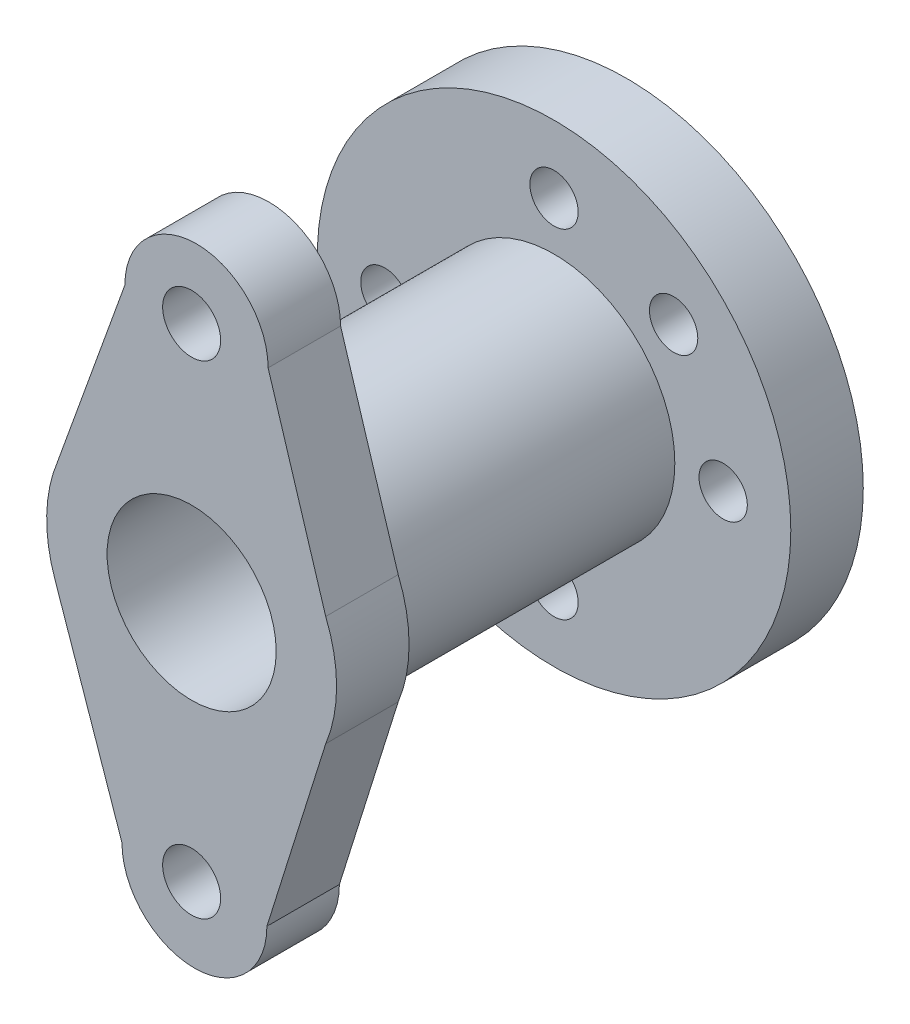
ISO-10303-21;
HEADER;
FILE_DESCRIPTION(('STEP AP214'),'2;1');
FILE_NAME('part.step','',(''),(''),'','','');
FILE_SCHEMA(('AUTOMOTIVE_DESIGN { 1 0 10303 214 1 1 1 1 }'));
ENDSEC;
DATA;
#1=APPLICATION_CONTEXT('core data for automotive mechanical design processes');
#2=APPLICATION_PROTOCOL_DEFINITION('international standard','automotive_design',2000,#1);
#3=PRODUCT_CONTEXT('',#1,'mechanical');
#4=PRODUCT('Part','Part','',(#3));
#5=PRODUCT_RELATED_PRODUCT_CATEGORY('part','',(#4));
#6=PRODUCT_DEFINITION_FORMATION('','',#4);
#7=PRODUCT_DEFINITION_CONTEXT('part definition',#1,'design');
#8=PRODUCT_DEFINITION('design','',#6,#7);
#9=PRODUCT_DEFINITION_SHAPE('','',#8);
#10=(LENGTH_UNIT() NAMED_UNIT(*) SI_UNIT(.MILLI.,.METRE.));
#11=(NAMED_UNIT(*) PLANE_ANGLE_UNIT() SI_UNIT($,.RADIAN.));
#12=(NAMED_UNIT(*) SI_UNIT($,.STERADIAN.) SOLID_ANGLE_UNIT());
#13=UNCERTAINTY_MEASURE_WITH_UNIT(LENGTH_MEASURE(1.E-05),#10,'distance_accuracy_value','');
#14=(GEOMETRIC_REPRESENTATION_CONTEXT(3) GLOBAL_UNCERTAINTY_ASSIGNED_CONTEXT((#13)) GLOBAL_UNIT_ASSIGNED_CONTEXT((#10,
#11,#12)) REPRESENTATION_CONTEXT('',''));
#15=CARTESIAN_POINT('',(0.,0.,0.));
#16=DIRECTION('',(0.,0.,1.));
#17=DIRECTION('',(1.,0.,0.));
#18=AXIS2_PLACEMENT_3D('',#15,#16,#17);
#19=CARTESIAN_POINT('',(2.0009573195602,-3.50167530923036,15.));
#20=DIRECTION('',(0.,0.,1.));
#21=DIRECTION('',(1.,0.,0.));
#22=AXIS2_PLACEMENT_3D('',#19,#20,#21);
#23=PLANE('',#22);
#24=CARTESIAN_POINT('',(2.0009573195602,-3.50167530923036,15.));
#25=DIRECTION('',(0.,0.,1.));
#26=DIRECTION('',(1.,0.,0.));
#27=AXIS2_PLACEMENT_3D('',#24,#25,#26);
#28=CIRCLE('',#27,25.);
#29=CARTESIAN_POINT('',(27.0009573195602,-3.50167530923036,15.));
#30=VERTEX_POINT('',#29);
#31=EDGE_CURVE('E12',#30,#30,#28,.T.);
#32=ORIENTED_EDGE('',*,*,#31,.F.);
#33=EDGE_LOOP('',(#32));
#34=FACE_BOUND('',#33,.T.);
#35=CARTESIAN_POINT('',(26.7496946610893,21.2470620322989,15.));
#36=DIRECTION('',(0.,0.,1.));
#37=DIRECTION('',(1.,0.,0.));
#38=AXIS2_PLACEMENT_3D('',#35,#36,#37);
#39=CIRCLE('',#38,5.);
#40=CARTESIAN_POINT('',(31.7496946610893,21.2470620322989,15.));
#41=VERTEX_POINT('',#40);
#42=EDGE_CURVE('E229',#41,#41,#39,.T.);
#43=ORIENTED_EDGE('',*,*,#42,.F.);
#44=EDGE_LOOP('',(#43));
#45=FACE_BOUND('',#44,.T.);
#46=CARTESIAN_POINT('',(2.0009573195602,-38.5016753092304,15.));
#47=DIRECTION('',(0.,0.,1.));
#48=DIRECTION('',(1.,0.,0.));
#49=AXIS2_PLACEMENT_3D('',#46,#47,#48);
#50=CIRCLE('',#49,5.);
#51=CARTESIAN_POINT('',(7.0009573195602,-38.5016753092304,15.));
#52=VERTEX_POINT('',#51);
#53=EDGE_CURVE('E241',#52,#52,#50,.T.);
#54=ORIENTED_EDGE('',*,*,#53,.F.);
#55=EDGE_LOOP('',(#54));
#56=FACE_BOUND('',#55,.T.);
#57=CARTESIAN_POINT('',(2.0009573195602,31.4983246907696,15.));
#58=DIRECTION('',(0.,0.,1.));
#59=DIRECTION('',(1.,0.,0.));
#60=AXIS2_PLACEMENT_3D('',#57,#58,#59);
#61=CIRCLE('',#60,5.);
#62=CARTESIAN_POINT('',(7.0009573195602,31.4983246907696,15.));
#63=VERTEX_POINT('',#62);
#64=EDGE_CURVE('E253',#63,#63,#61,.T.);
#65=ORIENTED_EDGE('',*,*,#64,.F.);
#66=EDGE_LOOP('',(#65));
#67=FACE_BOUND('',#66,.T.);
#68=CARTESIAN_POINT('',(2.0009573195602,-3.50167530923036,15.));
#69=DIRECTION('',(0.,0.,1.));
#70=DIRECTION('',(1.,0.,0.));
#71=AXIS2_PLACEMENT_3D('',#68,#69,#70);
#72=CIRCLE('',#71,49.);
#73=CARTESIAN_POINT('',(51.0009573195602,-3.50167530923036,15.));
#74=VERTEX_POINT('',#73);
#75=EDGE_CURVE('E51',#74,#74,#72,.T.);
#76=ORIENTED_EDGE('',*,*,#75,.T.);
#77=EDGE_LOOP('',(#76));
#78=FACE_BOUND('',#77,.T.);
#79=CARTESIAN_POINT('',(37.0009573195602,-3.50167530923036,15.));
#80=DIRECTION('',(0.,0.,1.));
#81=DIRECTION('',(1.,0.,0.));
#82=AXIS2_PLACEMENT_3D('',#79,#80,#81);
#83=CIRCLE('',#82,5.);
#84=CARTESIAN_POINT('',(42.0009573195602,-3.50167530923036,15.));
#85=VERTEX_POINT('',#84);
#86=EDGE_CURVE('E247',#85,#85,#83,.T.);
#87=ORIENTED_EDGE('',*,*,#86,.F.);
#88=EDGE_LOOP('',(#87));
#89=FACE_BOUND('',#88,.T.);
#90=CARTESIAN_POINT('',(-32.9990426804398,-3.50167530923036,15.));
#91=DIRECTION('',(0.,0.,1.));
#92=DIRECTION('',(1.,0.,0.));
#93=AXIS2_PLACEMENT_3D('',#90,#91,#92);
#94=CIRCLE('',#93,5.);
#95=CARTESIAN_POINT('',(-27.9990426804398,-3.50167530923036,15.));
#96=VERTEX_POINT('',#95);
#97=EDGE_CURVE('E235',#96,#96,#94,.T.);
#98=ORIENTED_EDGE('',*,*,#97,.F.);
#99=EDGE_LOOP('',(#98));
#100=FACE_BOUND('',#99,.T.);
#101=CARTESIAN_POINT('',(-22.7477800219689,-28.2504126507596,15.));
#102=DIRECTION('',(0.,0.,1.));
#103=DIRECTION('',(1.,0.,0.));
#104=AXIS2_PLACEMENT_3D('',#101,#102,#103);
#105=CIRCLE('',#104,5.);
#106=CARTESIAN_POINT('',(-17.7477800219689,-28.2504126507596,15.));
#107=VERTEX_POINT('',#106);
#108=EDGE_CURVE('E223',#107,#107,#105,.T.);
#109=ORIENTED_EDGE('',*,*,#108,.F.);
#110=EDGE_LOOP('',(#109));
#111=FACE_BOUND('',#110,.T.);
#112=ADVANCED_FACE('F41',(#34,#45,#56,#67,#78,#89,#100,#111),#23,.T.);
#113=CARTESIAN_POINT('',(2.0009573195602,-3.50167530923036,0.));
#114=DIRECTION('',(0.,0.,1.));
#115=DIRECTION('',(1.,0.,0.));
#116=AXIS2_PLACEMENT_3D('',#113,#114,#115);
#117=PLANE('',#116);
#118=CARTESIAN_POINT('',(2.0009573195602,-3.50167530923036,0.));
#119=DIRECTION('',(0.,0.,1.));
#120=DIRECTION('',(1.,0.,0.));
#121=AXIS2_PLACEMENT_3D('',#118,#119,#120);
#122=CIRCLE('',#121,49.);
#123=CARTESIAN_POINT('',(51.0009573195602,-3.50167530923036,0.));
#124=VERTEX_POINT('',#123);
#125=EDGE_CURVE('E45',#124,#124,#122,.T.);
#126=ORIENTED_EDGE('',*,*,#125,.F.);
#127=EDGE_LOOP('',(#126));
#128=FACE_BOUND('',#127,.T.);
#129=CARTESIAN_POINT('',(2.0009573195602,31.4983246907696,0.));
#130=DIRECTION('',(0.,0.,1.));
#131=DIRECTION('',(1.,0.,0.));
#132=AXIS2_PLACEMENT_3D('',#129,#130,#131);
#133=CIRCLE('',#132,5.);
#134=CARTESIAN_POINT('',(7.0009573195602,31.4983246907696,0.));
#135=VERTEX_POINT('',#134);
#136=EDGE_CURVE('E250',#135,#135,#133,.T.);
#137=ORIENTED_EDGE('',*,*,#136,.T.);
#138=EDGE_LOOP('',(#137));
#139=FACE_BOUND('',#138,.T.);
#140=CARTESIAN_POINT('',(37.0009573195602,-3.50167530923036,0.));
#141=DIRECTION('',(0.,0.,1.));
#142=DIRECTION('',(1.,0.,0.));
#143=AXIS2_PLACEMENT_3D('',#140,#141,#142);
#144=CIRCLE('',#143,5.);
#145=CARTESIAN_POINT('',(42.0009573195602,-3.50167530923036,0.));
#146=VERTEX_POINT('',#145);
#147=EDGE_CURVE('E244',#146,#146,#144,.T.);
#148=ORIENTED_EDGE('',*,*,#147,.T.);
#149=EDGE_LOOP('',(#148));
#150=FACE_BOUND('',#149,.T.);
#151=CARTESIAN_POINT('',(2.0009573195602,-38.5016753092304,0.));
#152=DIRECTION('',(0.,0.,1.));
#153=DIRECTION('',(1.,0.,0.));
#154=AXIS2_PLACEMENT_3D('',#151,#152,#153);
#155=CIRCLE('',#154,5.);
#156=CARTESIAN_POINT('',(7.0009573195602,-38.5016753092304,0.));
#157=VERTEX_POINT('',#156);
#158=EDGE_CURVE('E238',#157,#157,#155,.T.);
#159=ORIENTED_EDGE('',*,*,#158,.T.);
#160=EDGE_LOOP('',(#159));
#161=FACE_BOUND('',#160,.T.);
#162=CARTESIAN_POINT('',(-32.9990426804398,-3.50167530923036,0.));
#163=DIRECTION('',(0.,0.,1.));
#164=DIRECTION('',(1.,0.,0.));
#165=AXIS2_PLACEMENT_3D('',#162,#163,#164);
#166=CIRCLE('',#165,5.);
#167=CARTESIAN_POINT('',(-27.9990426804398,-3.50167530923036,0.));
#168=VERTEX_POINT('',#167);
#169=EDGE_CURVE('E232',#168,#168,#166,.T.);
#170=ORIENTED_EDGE('',*,*,#169,.T.);
#171=EDGE_LOOP('',(#170));
#172=FACE_BOUND('',#171,.T.);
#173=CARTESIAN_POINT('',(26.7496946610893,21.2470620322989,0.));
#174=DIRECTION('',(0.,0.,1.));
#175=DIRECTION('',(1.,0.,0.));
#176=AXIS2_PLACEMENT_3D('',#173,#174,#175);
#177=CIRCLE('',#176,5.);
#178=CARTESIAN_POINT('',(31.7496946610893,21.2470620322989,0.));
#179=VERTEX_POINT('',#178);
#180=EDGE_CURVE('E226',#179,#179,#177,.T.);
#181=ORIENTED_EDGE('',*,*,#180,.T.);
#182=EDGE_LOOP('',(#181));
#183=FACE_BOUND('',#182,.T.);
#184=CARTESIAN_POINT('',(-22.7477800219689,-28.2504126507596,0.));
#185=DIRECTION('',(0.,0.,1.));
#186=DIRECTION('',(1.,0.,0.));
#187=AXIS2_PLACEMENT_3D('',#184,#185,#186);
#188=CIRCLE('',#187,5.);
#189=CARTESIAN_POINT('',(-17.7477800219689,-28.2504126507596,0.));
#190=VERTEX_POINT('',#189);
#191=EDGE_CURVE('E221',#190,#190,#188,.T.);
#192=ORIENTED_EDGE('',*,*,#191,.T.);
#193=EDGE_LOOP('',(#192));
#194=FACE_BOUND('',#193,.T.);
#195=ADVANCED_FACE('F264',(#128,#139,#150,#161,#172,#183,#194),#117,.F.);
#196=CARTESIAN_POINT('',(2.0009573195602,-3.50167530923036,15.));
#197=DIRECTION('',(0.,0.,-1.));
#198=DIRECTION('',(-1.,0.,0.));
#199=AXIS2_PLACEMENT_3D('',#196,#197,#198);
#200=CYLINDRICAL_SURFACE('',#199,49.);
#201=ORIENTED_EDGE('',*,*,#75,.F.);
#202=EDGE_LOOP('',(#201));
#203=FACE_BOUND('',#202,.T.);
#204=ORIENTED_EDGE('',*,*,#125,.T.);
#205=EDGE_LOOP('',(#204));
#206=FACE_BOUND('',#205,.T.);
#207=ADVANCED_FACE('F43',(#203,#206),#200,.T.);
#208=CARTESIAN_POINT('',(2.0009573195602,31.4983246907696,15.));
#209=DIRECTION('',(0.,0.,-1.));
#210=DIRECTION('',(-1.,0.,0.));
#211=AXIS2_PLACEMENT_3D('',#208,#209,#210);
#212=CYLINDRICAL_SURFACE('',#211,5.);
#213=ORIENTED_EDGE('',*,*,#64,.T.);
#214=EDGE_LOOP('',(#213));
#215=FACE_BOUND('',#214,.T.);
#216=ORIENTED_EDGE('',*,*,#136,.F.);
#217=EDGE_LOOP('',(#216));
#218=FACE_BOUND('',#217,.T.);
#219=ADVANCED_FACE('F302',(#215,#218),#212,.F.);
#220=CARTESIAN_POINT('',(37.0009573195602,-3.50167530923036,15.));
#221=DIRECTION('',(0.,0.,-1.));
#222=DIRECTION('',(-1.,0.,0.));
#223=AXIS2_PLACEMENT_3D('',#220,#221,#222);
#224=CYLINDRICAL_SURFACE('',#223,5.);
#225=ORIENTED_EDGE('',*,*,#86,.T.);
#226=EDGE_LOOP('',(#225));
#227=FACE_BOUND('',#226,.T.);
#228=ORIENTED_EDGE('',*,*,#147,.F.);
#229=EDGE_LOOP('',(#228));
#230=FACE_BOUND('',#229,.T.);
#231=ADVANCED_FACE('F305',(#227,#230),#224,.F.);
#232=CARTESIAN_POINT('',(2.0009573195602,-38.5016753092304,15.));
#233=DIRECTION('',(0.,0.,-1.));
#234=DIRECTION('',(-1.,0.,0.));
#235=AXIS2_PLACEMENT_3D('',#232,#233,#234);
#236=CYLINDRICAL_SURFACE('',#235,5.);
#237=ORIENTED_EDGE('',*,*,#53,.T.);
#238=EDGE_LOOP('',(#237));
#239=FACE_BOUND('',#238,.T.);
#240=ORIENTED_EDGE('',*,*,#158,.F.);
#241=EDGE_LOOP('',(#240));
#242=FACE_BOUND('',#241,.T.);
#243=ADVANCED_FACE('F309',(#239,#242),#236,.F.);
#244=CARTESIAN_POINT('',(-32.9990426804398,-3.50167530923036,15.));
#245=DIRECTION('',(0.,0.,-1.));
#246=DIRECTION('',(-1.,0.,0.));
#247=AXIS2_PLACEMENT_3D('',#244,#245,#246);
#248=CYLINDRICAL_SURFACE('',#247,5.);
#249=ORIENTED_EDGE('',*,*,#97,.T.);
#250=EDGE_LOOP('',(#249));
#251=FACE_BOUND('',#250,.T.);
#252=ORIENTED_EDGE('',*,*,#169,.F.);
#253=EDGE_LOOP('',(#252));
#254=FACE_BOUND('',#253,.T.);
#255=ADVANCED_FACE('F291',(#251,#254),#248,.F.);
#256=CARTESIAN_POINT('',(26.7496946610893,21.2470620322989,15.));
#257=DIRECTION('',(0.,0.,-1.));
#258=DIRECTION('',(-1.,0.,0.));
#259=AXIS2_PLACEMENT_3D('',#256,#257,#258);
#260=CYLINDRICAL_SURFACE('',#259,5.);
#261=ORIENTED_EDGE('',*,*,#42,.T.);
#262=EDGE_LOOP('',(#261));
#263=FACE_BOUND('',#262,.T.);
#264=ORIENTED_EDGE('',*,*,#180,.F.);
#265=EDGE_LOOP('',(#264));
#266=FACE_BOUND('',#265,.T.);
#267=ADVANCED_FACE('F282',(#263,#266),#260,.F.);
#268=CARTESIAN_POINT('',(-22.7477800219689,-28.2504126507596,15.));
#269=DIRECTION('',(0.,0.,-1.));
#270=DIRECTION('',(-1.,0.,0.));
#271=AXIS2_PLACEMENT_3D('',#268,#269,#270);
#272=CYLINDRICAL_SURFACE('',#271,5.);
#273=ORIENTED_EDGE('',*,*,#108,.T.);
#274=EDGE_LOOP('',(#273));
#275=FACE_BOUND('',#274,.T.);
#276=ORIENTED_EDGE('',*,*,#191,.F.);
#277=EDGE_LOOP('',(#276));
#278=FACE_BOUND('',#277,.T.);
#279=ADVANCED_FACE('F279',(#275,#278),#272,.F.);
#280=CARTESIAN_POINT('',(2.0009573195602,-3.50167530923036,75.));
#281=DIRECTION('',(0.,0.,-1.));
#282=DIRECTION('',(-1.,0.,0.));
#283=AXIS2_PLACEMENT_3D('',#280,#281,#282);
#284=CYLINDRICAL_SURFACE('',#283,25.);
#285=CARTESIAN_POINT('',(2.0009573195602,-3.50167530923036,75.));
#286=DIRECTION('',(0.,0.,1.));
#287=DIRECTION('',(1.,0.,0.));
#288=AXIS2_PLACEMENT_3D('',#285,#286,#287);
#289=CIRCLE('',#288,25.);
#290=CARTESIAN_POINT('',(27.0009573195602,-3.50167530923036,75.));
#291=VERTEX_POINT('',#290);
#292=EDGE_CURVE('E219',#291,#291,#289,.T.);
#293=ORIENTED_EDGE('',*,*,#292,.F.);
#294=EDGE_LOOP('',(#293));
#295=FACE_BOUND('',#294,.T.);
#296=ORIENTED_EDGE('',*,*,#31,.T.);
#297=EDGE_LOOP('',(#296));
#298=FACE_BOUND('',#297,.T.);
#299=ADVANCED_FACE('F281',(#295,#298),#284,.T.);
#300=CARTESIAN_POINT('',(0.,0.,75.));
#301=DIRECTION('',(0.,0.,-1.));
#302=DIRECTION('',(-1.,0.,0.));
#303=AXIS2_PLACEMENT_3D('',#300,#301,#302);
#304=PLANE('',#303);
#305=ORIENTED_EDGE('',*,*,#292,.T.);
#306=EDGE_LOOP('',(#305));
#307=FACE_BOUND('',#306,.T.);
#308=CARTESIAN_POINT('',(2.0009573195602,46.5010851804684,75.));
#309=DIRECTION('',(0.,0.,1.));
#310=DIRECTION('',(1.,0.,0.));
#311=AXIS2_PLACEMENT_3D('',#308,#309,#310);
#312=CIRCLE('',#311,6.);
#313=CARTESIAN_POINT('',(8.0009573195602,46.5010851804684,75.));
#314=VERTEX_POINT('',#313);
#315=EDGE_CURVE('E135',#314,#314,#312,.T.);
#316=ORIENTED_EDGE('',*,*,#315,.T.);
#317=EDGE_LOOP('',(#316));
#318=FACE_BOUND('',#317,.T.);
#319=CARTESIAN_POINT('',(2.57930255673431,-53.7079312906423,75.));
#320=DIRECTION('',(0.,0.,1.));
#321=DIRECTION('',(1.,0.,0.));
#322=AXIS2_PLACEMENT_3D('',#319,#320,#321);
#323=CIRCLE('',#322,15.);
#324=CARTESIAN_POINT('',(-12.4206974432657,-53.7079312906423,75.));
#325=VERTEX_POINT('',#324);
#326=CARTESIAN_POINT('',(17.5793025567343,-53.7079312906423,75.));
#327=VERTEX_POINT('',#326);
#328=EDGE_CURVE('E131',#325,#327,#323,.T.);
#329=ORIENTED_EDGE('',*,*,#328,.F.);
#330=DIRECTION('',(0.325940739036391,-0.9453902023167,0.));
#331=VECTOR('',#330,1.);
#332=CARTESIAN_POINT('',(-12.4206974432657,-53.7079312906423,75.));
#333=LINE('',#332,#331);
#334=CARTESIAN_POINT('',(-26.2568050216251,-13.5763399423131,75.));
#335=VERTEX_POINT('',#334);
#336=EDGE_CURVE('E106',#335,#325,#333,.T.);
#337=ORIENTED_EDGE('',*,*,#336,.F.);
#338=CARTESIAN_POINT('',(2.0009573195602,-3.50167530923036,75.));
#339=DIRECTION('',(0.,0.,1.));
#340=DIRECTION('',(1.,0.,0.));
#341=AXIS2_PLACEMENT_3D('',#338,#339,#340);
#342=CIRCLE('',#341,30.);
#343=CARTESIAN_POINT('',(-25.7458515982972,7.90510315254003,75.));
#344=VERTEX_POINT('',#343);
#345=EDGE_CURVE('E113',#344,#335,#342,.T.);
#346=ORIENTED_EDGE('',*,*,#345,.F.);
#347=DIRECTION('',(-0.339419327269756,-0.940635168530152,0.));
#348=VECTOR('',#347,1.);
#349=CARTESIAN_POINT('',(-11.819851667689,46.4983246907697,75.));
#350=LINE('',#349,#348);
#351=CARTESIAN_POINT('',(-11.819851667689,46.4983246907697,75.));
#352=VERTEX_POINT('',#351);
#353=EDGE_CURVE('E198',#352,#344,#350,.T.);
#354=ORIENTED_EDGE('',*,*,#353,.F.);
#355=CARTESIAN_POINT('',(3.00438617084908,46.4983246907696,75.));
#356=DIRECTION('',(0.,0.,1.));
#357=DIRECTION('',(1.,0.,0.));
#358=AXIS2_PLACEMENT_3D('',#355,#356,#357);
#359=CIRCLE('',#358,14.8242378385381);
#360=CARTESIAN_POINT('',(17.8286240093871,46.4983246907696,75.));
#361=VERTEX_POINT('',#360);
#362=EDGE_CURVE('E184',#361,#352,#359,.T.);
#363=ORIENTED_EDGE('',*,*,#362,.F.);
#364=DIRECTION('',(-0.295087697485455,0.955470172633731,0.));
#365=VECTOR('',#364,1.);
#366=CARTESIAN_POINT('',(17.8286240093871,46.4983246907696,75.));
#367=LINE('',#366,#365);
#368=CARTESIAN_POINT('',(29.7477662374176,7.90510315254003,75.));
#369=VERTEX_POINT('',#368);
#370=EDGE_CURVE('E170',#369,#361,#367,.T.);
#371=ORIENTED_EDGE('',*,*,#370,.F.);
#372=CARTESIAN_POINT('',(2.0009573195602,-3.50167530923036,75.));
#373=DIRECTION('',(0.,0.,1.));
#374=DIRECTION('',(1.,0.,0.));
#375=AXIS2_PLACEMENT_3D('',#372,#373,#374);
#376=CIRCLE('',#375,30.);
#377=CARTESIAN_POINT('',(29.7477662374176,-14.9084537710008,75.));
#378=VERTEX_POINT('',#377);
#379=EDGE_CURVE('E156',#378,#369,#376,.T.);
#380=ORIENTED_EDGE('',*,*,#379,.F.);
#381=DIRECTION('',(0.29925227709934,0.95417402744513,0.));
#382=VECTOR('',#381,1.);
#383=CARTESIAN_POINT('',(17.5793025567343,-53.7079312906423,75.));
#384=LINE('',#383,#382);
#385=EDGE_CURVE('E147',#327,#378,#384,.T.);
#386=ORIENTED_EDGE('',*,*,#385,.F.);
#387=EDGE_LOOP('',(#329,#337,#346,#354,#363,#371,#380,#386));
#388=FACE_BOUND('',#387,.T.);
#389=CARTESIAN_POINT('',(2.0009573195602,-53.5028788227911,75.));
#390=DIRECTION('',(0.,0.,1.));
#391=DIRECTION('',(1.,0.,0.));
#392=AXIS2_PLACEMENT_3D('',#389,#390,#391);
#393=CIRCLE('',#392,6.);
#394=CARTESIAN_POINT('',(8.0009573195602,-53.5028788227911,75.));
#395=VERTEX_POINT('',#394);
#396=EDGE_CURVE('E490',#395,#395,#393,.T.);
#397=ORIENTED_EDGE('',*,*,#396,.T.);
#398=EDGE_LOOP('',(#397));
#399=FACE_BOUND('',#398,.T.);
#400=ADVANCED_FACE('F128',(#307,#318,#388,#399),#304,.T.);
#401=CARTESIAN_POINT('',(0.,0.,90.));
#402=DIRECTION('',(0.,0.,-1.));
#403=DIRECTION('',(-1.,0.,0.));
#404=AXIS2_PLACEMENT_3D('',#401,#402,#403);
#405=PLANE('',#404);
#406=CARTESIAN_POINT('',(2.57930255673431,-53.7079312906423,90.));
#407=DIRECTION('',(0.,0.,1.));
#408=DIRECTION('',(1.,0.,0.));
#409=AXIS2_PLACEMENT_3D('',#406,#407,#408);
#410=CIRCLE('',#409,15.);
#411=CARTESIAN_POINT('',(-12.4206974432657,-53.7079312906423,90.));
#412=VERTEX_POINT('',#411);
#413=CARTESIAN_POINT('',(17.5793025567343,-53.7079312906423,90.));
#414=VERTEX_POINT('',#413);
#415=EDGE_CURVE('E144',#412,#414,#410,.T.);
#416=ORIENTED_EDGE('',*,*,#415,.T.);
#417=DIRECTION('',(0.29925227709934,0.95417402744513,0.));
#418=VECTOR('',#417,1.);
#419=CARTESIAN_POINT('',(17.5793025567343,-53.7079312906423,90.));
#420=LINE('',#419,#418);
#421=CARTESIAN_POINT('',(29.7477662374176,-14.9084537710008,90.));
#422=VERTEX_POINT('',#421);
#423=EDGE_CURVE('E60',#414,#422,#420,.T.);
#424=ORIENTED_EDGE('',*,*,#423,.T.);
#425=CARTESIAN_POINT('',(2.0009573195602,-3.50167530923036,90.));
#426=DIRECTION('',(0.,0.,1.));
#427=DIRECTION('',(1.,0.,0.));
#428=AXIS2_PLACEMENT_3D('',#425,#426,#427);
#429=CIRCLE('',#428,30.);
#430=CARTESIAN_POINT('',(29.7477662374176,7.90510315254003,90.));
#431=VERTEX_POINT('',#430);
#432=EDGE_CURVE('E150',#422,#431,#429,.T.);
#433=ORIENTED_EDGE('',*,*,#432,.T.);
#434=DIRECTION('',(-0.295087697485455,0.955470172633731,0.));
#435=VECTOR('',#434,1.);
#436=CARTESIAN_POINT('',(17.8286240093871,46.4983246907696,90.));
#437=LINE('',#436,#435);
#438=CARTESIAN_POINT('',(17.8286240093871,46.4983246907696,90.));
#439=VERTEX_POINT('',#438);
#440=EDGE_CURVE('E164',#431,#439,#437,.T.);
#441=ORIENTED_EDGE('',*,*,#440,.T.);
#442=CARTESIAN_POINT('',(3.00438617084908,46.4983246907696,90.));
#443=DIRECTION('',(0.,0.,1.));
#444=DIRECTION('',(1.,0.,0.));
#445=AXIS2_PLACEMENT_3D('',#442,#443,#444);
#446=CIRCLE('',#445,14.8242378385381);
#447=CARTESIAN_POINT('',(-11.819851667689,46.4983246907697,90.));
#448=VERTEX_POINT('',#447);
#449=EDGE_CURVE('E178',#439,#448,#446,.T.);
#450=ORIENTED_EDGE('',*,*,#449,.T.);
#451=DIRECTION('',(-0.339419327269756,-0.940635168530152,0.));
#452=VECTOR('',#451,1.);
#453=CARTESIAN_POINT('',(-11.819851667689,46.4983246907697,90.));
#454=LINE('',#453,#452);
#455=CARTESIAN_POINT('',(-25.7458515982972,7.90510315254002,90.));
#456=VERTEX_POINT('',#455);
#457=EDGE_CURVE('E192',#448,#456,#454,.T.);
#458=ORIENTED_EDGE('',*,*,#457,.T.);
#459=CARTESIAN_POINT('',(2.0009573195602,-3.50167530923036,90.));
#460=DIRECTION('',(0.,0.,1.));
#461=DIRECTION('',(1.,0.,0.));
#462=AXIS2_PLACEMENT_3D('',#459,#460,#461);
#463=CIRCLE('',#462,30.);
#464=CARTESIAN_POINT('',(-26.2568050216251,-13.5763399423131,90.));
#465=VERTEX_POINT('',#464);
#466=EDGE_CURVE('E206',#456,#465,#463,.T.);
#467=ORIENTED_EDGE('',*,*,#466,.T.);
#468=DIRECTION('',(0.325940739036391,-0.9453902023167,0.));
#469=VECTOR('',#468,1.);
#470=CARTESIAN_POINT('',(-12.4206974432657,-53.7079312906423,90.));
#471=LINE('',#470,#469);
#472=EDGE_CURVE('E125',#465,#412,#471,.T.);
#473=ORIENTED_EDGE('',*,*,#472,.T.);
#474=EDGE_LOOP('',(#416,#424,#433,#441,#450,#458,#467,#473));
#475=FACE_BOUND('',#474,.T.);
#476=CARTESIAN_POINT('',(2.0009573195602,-3.50167530923036,90.));
#477=DIRECTION('',(0.,0.,1.));
#478=DIRECTION('',(1.,0.,0.));
#479=AXIS2_PLACEMENT_3D('',#476,#477,#478);
#480=CIRCLE('',#479,17.5);
#481=CARTESIAN_POINT('',(19.5009573195602,-3.50167530923036,90.));
#482=VERTEX_POINT('',#481);
#483=EDGE_CURVE('E132',#482,#482,#480,.T.);
#484=ORIENTED_EDGE('',*,*,#483,.F.);
#485=EDGE_LOOP('',(#484));
#486=FACE_BOUND('',#485,.T.);
#487=CARTESIAN_POINT('',(2.0009573195602,46.5010851804684,90.));
#488=DIRECTION('',(0.,0.,1.));
#489=DIRECTION('',(1.,0.,0.));
#490=AXIS2_PLACEMENT_3D('',#487,#488,#489);
#491=CIRCLE('',#490,6.);
#492=CARTESIAN_POINT('',(8.0009573195602,46.5010851804684,90.));
#493=VERTEX_POINT('',#492);
#494=EDGE_CURVE('E495',#493,#493,#491,.T.);
#495=ORIENTED_EDGE('',*,*,#494,.F.);
#496=EDGE_LOOP('',(#495));
#497=FACE_BOUND('',#496,.T.);
#498=CARTESIAN_POINT('',(2.0009573195602,-53.5028788227911,90.));
#499=DIRECTION('',(0.,0.,1.));
#500=DIRECTION('',(1.,0.,0.));
#501=AXIS2_PLACEMENT_3D('',#498,#499,#500);
#502=CIRCLE('',#501,6.);
#503=CARTESIAN_POINT('',(8.0009573195602,-53.5028788227911,90.));
#504=VERTEX_POINT('',#503);
#505=EDGE_CURVE('E487',#504,#504,#502,.T.);
#506=ORIENTED_EDGE('',*,*,#505,.F.);
#507=EDGE_LOOP('',(#506));
#508=FACE_BOUND('',#507,.T.);
#509=ADVANCED_FACE('F353',(#475,#486,#497,#508),#405,.F.);
#510=CARTESIAN_POINT('',(-12.4206974432657,-53.7079312906423,90.));
#511=DIRECTION('',(0.9453902023167,0.325940739036391,0.));
#512=DIRECTION('',(-0.325940739036391,0.9453902023167,0.));
#513=AXIS2_PLACEMENT_3D('',#510,#511,#512);
#514=PLANE('',#513);
#515=ORIENTED_EDGE('',*,*,#336,.T.);
#516=DIRECTION('',(0.,0.,-1.));
#517=VECTOR('',#516,1.);
#518=CARTESIAN_POINT('',(-12.4206974432657,-53.7079312906423,90.));
#519=LINE('',#518,#517);
#520=EDGE_CURVE('E121',#412,#325,#519,.T.);
#521=ORIENTED_EDGE('',*,*,#520,.F.);
#522=ORIENTED_EDGE('',*,*,#472,.F.);
#523=DIRECTION('',(0.,0.,-1.));
#524=VECTOR('',#523,1.);
#525=CARTESIAN_POINT('',(-26.2568050216251,-13.5763399423131,90.));
#526=LINE('',#525,#524);
#527=EDGE_CURVE('E115',#465,#335,#526,.T.);
#528=ORIENTED_EDGE('',*,*,#527,.T.);
#529=EDGE_LOOP('',(#515,#521,#522,#528));
#530=FACE_BOUND('',#529,.T.);
#531=ADVANCED_FACE('F123',(#530),#514,.F.);
#532=CARTESIAN_POINT('',(2.0009573195602,-3.50167530923036,90.));
#533=DIRECTION('',(0.,0.,-1.));
#534=DIRECTION('',(-1.,0.,0.));
#535=AXIS2_PLACEMENT_3D('',#532,#533,#534);
#536=CYLINDRICAL_SURFACE('',#535,30.);
#537=ORIENTED_EDGE('',*,*,#345,.T.);
#538=ORIENTED_EDGE('',*,*,#527,.F.);
#539=ORIENTED_EDGE('',*,*,#466,.F.);
#540=DIRECTION('',(0.,0.,-1.));
#541=VECTOR('',#540,1.);
#542=CARTESIAN_POINT('',(-25.7458515982972,7.90510315254002,90.));
#543=LINE('',#542,#541);
#544=EDGE_CURVE('E118',#456,#344,#543,.T.);
#545=ORIENTED_EDGE('',*,*,#544,.T.);
#546=EDGE_LOOP('',(#537,#538,#539,#545));
#547=FACE_BOUND('',#546,.T.);
#548=ADVANCED_FACE('F114',(#547),#536,.T.);
#549=CARTESIAN_POINT('',(-11.819851667689,46.4983246907697,90.));
#550=DIRECTION('',(0.940635168530151,-0.339419327269755,0.));
#551=DIRECTION('',(0.339419327269755,0.940635168530151,0.));
#552=AXIS2_PLACEMENT_3D('',#549,#550,#551);
#553=PLANE('',#552);
#554=ORIENTED_EDGE('',*,*,#353,.T.);
#555=ORIENTED_EDGE('',*,*,#544,.F.);
#556=ORIENTED_EDGE('',*,*,#457,.F.);
#557=DIRECTION('',(0.,0.,-1.));
#558=VECTOR('',#557,1.);
#559=CARTESIAN_POINT('',(-11.819851667689,46.4983246907697,90.));
#560=LINE('',#559,#558);
#561=EDGE_CURVE('E195',#448,#352,#560,.T.);
#562=ORIENTED_EDGE('',*,*,#561,.T.);
#563=EDGE_LOOP('',(#554,#555,#556,#562));
#564=FACE_BOUND('',#563,.T.);
#565=ADVANCED_FACE('F382',(#564),#553,.F.);
#566=CARTESIAN_POINT('',(3.00438617084908,46.4983246907696,90.));
#567=DIRECTION('',(0.,0.,-1.));
#568=DIRECTION('',(-1.,0.,0.));
#569=AXIS2_PLACEMENT_3D('',#566,#567,#568);
#570=CYLINDRICAL_SURFACE('',#569,14.8242378385381);
#571=ORIENTED_EDGE('',*,*,#362,.T.);
#572=ORIENTED_EDGE('',*,*,#561,.F.);
#573=ORIENTED_EDGE('',*,*,#449,.F.);
#574=DIRECTION('',(0.,0.,-1.));
#575=VECTOR('',#574,1.);
#576=CARTESIAN_POINT('',(17.8286240093871,46.4983246907696,90.));
#577=LINE('',#576,#575);
#578=EDGE_CURVE('E181',#439,#361,#577,.T.);
#579=ORIENTED_EDGE('',*,*,#578,.T.);
#580=EDGE_LOOP('',(#571,#572,#573,#579));
#581=FACE_BOUND('',#580,.T.);
#582=ADVANCED_FACE('F391',(#581),#570,.T.);
#583=CARTESIAN_POINT('',(17.8286240093871,46.4983246907696,90.));
#584=DIRECTION('',(-0.955470172633731,-0.295087697485455,0.));
#585=DIRECTION('',(0.295087697485455,-0.955470172633731,0.));
#586=AXIS2_PLACEMENT_3D('',#583,#584,#585);
#587=PLANE('',#586);
#588=ORIENTED_EDGE('',*,*,#370,.T.);
#589=ORIENTED_EDGE('',*,*,#578,.F.);
#590=ORIENTED_EDGE('',*,*,#440,.F.);
#591=DIRECTION('',(0.,0.,-1.));
#592=VECTOR('',#591,1.);
#593=CARTESIAN_POINT('',(29.7477662374176,7.90510315254003,90.));
#594=LINE('',#593,#592);
#595=EDGE_CURVE('E167',#431,#369,#594,.T.);
#596=ORIENTED_EDGE('',*,*,#595,.T.);
#597=EDGE_LOOP('',(#588,#589,#590,#596));
#598=FACE_BOUND('',#597,.T.);
#599=ADVANCED_FACE('F401',(#598),#587,.F.);
#600=CARTESIAN_POINT('',(2.0009573195602,-3.50167530923036,90.));
#601=DIRECTION('',(0.,0.,-1.));
#602=DIRECTION('',(-1.,0.,0.));
#603=AXIS2_PLACEMENT_3D('',#600,#601,#602);
#604=CYLINDRICAL_SURFACE('',#603,30.);
#605=ORIENTED_EDGE('',*,*,#379,.T.);
#606=ORIENTED_EDGE('',*,*,#595,.F.);
#607=ORIENTED_EDGE('',*,*,#432,.F.);
#608=DIRECTION('',(0.,0.,-1.));
#609=VECTOR('',#608,1.);
#610=CARTESIAN_POINT('',(29.7477662374176,-14.9084537710008,90.));
#611=LINE('',#610,#609);
#612=EDGE_CURVE('E153',#422,#378,#611,.T.);
#613=ORIENTED_EDGE('',*,*,#612,.T.);
#614=EDGE_LOOP('',(#605,#606,#607,#613));
#615=FACE_BOUND('',#614,.T.);
#616=ADVANCED_FACE('F411',(#615),#604,.T.);
#617=CARTESIAN_POINT('',(17.5793025567343,-53.7079312906423,90.));
#618=DIRECTION('',(-0.95417402744513,0.29925227709934,0.));
#619=DIRECTION('',(-0.29925227709934,-0.95417402744513,0.));
#620=AXIS2_PLACEMENT_3D('',#617,#618,#619);
#621=PLANE('',#620);
#622=ORIENTED_EDGE('',*,*,#385,.T.);
#623=ORIENTED_EDGE('',*,*,#612,.F.);
#624=ORIENTED_EDGE('',*,*,#423,.F.);
#625=DIRECTION('',(0.,0.,-1.));
#626=VECTOR('',#625,1.);
#627=CARTESIAN_POINT('',(17.5793025567343,-53.7079312906423,90.));
#628=LINE('',#627,#626);
#629=EDGE_CURVE('E149',#414,#327,#628,.T.);
#630=ORIENTED_EDGE('',*,*,#629,.T.);
#631=EDGE_LOOP('',(#622,#623,#624,#630));
#632=FACE_BOUND('',#631,.T.);
#633=ADVANCED_FACE('F421',(#632),#621,.F.);
#634=CARTESIAN_POINT('',(2.57930255673431,-53.7079312906423,90.));
#635=DIRECTION('',(0.,0.,-1.));
#636=DIRECTION('',(-1.,0.,0.));
#637=AXIS2_PLACEMENT_3D('',#634,#635,#636);
#638=CYLINDRICAL_SURFACE('',#637,15.);
#639=ORIENTED_EDGE('',*,*,#328,.T.);
#640=ORIENTED_EDGE('',*,*,#629,.F.);
#641=ORIENTED_EDGE('',*,*,#415,.F.);
#642=ORIENTED_EDGE('',*,*,#520,.T.);
#643=EDGE_LOOP('',(#639,#640,#641,#642));
#644=FACE_BOUND('',#643,.T.);
#645=ADVANCED_FACE('F365',(#644),#638,.T.);
#646=CARTESIAN_POINT('',(2.0009573195602,-3.50167530923036,90.));
#647=DIRECTION('',(0.,0.,-1.));
#648=DIRECTION('',(-1.,0.,0.));
#649=AXIS2_PLACEMENT_3D('',#646,#647,#648);
#650=CYLINDRICAL_SURFACE('',#649,17.5);
#651=ORIENTED_EDGE('',*,*,#483,.T.);
#652=EDGE_LOOP('',(#651));
#653=FACE_BOUND('',#652,.T.);
#654=CARTESIAN_POINT('',(2.0009573195602,-3.50167530923036,15.));
#655=DIRECTION('',(0.,0.,1.));
#656=DIRECTION('',(1.,0.,0.));
#657=AXIS2_PLACEMENT_3D('',#654,#655,#656);
#658=CIRCLE('',#657,17.5);
#659=CARTESIAN_POINT('',(19.5009573195602,-3.50167530923036,15.));
#660=VERTEX_POINT('',#659);
#661=EDGE_CURVE('E485',#660,#660,#658,.T.);
#662=ORIENTED_EDGE('',*,*,#661,.F.);
#663=EDGE_LOOP('',(#662));
#664=FACE_BOUND('',#663,.T.);
#665=ADVANCED_FACE('F374',(#653,#664),#650,.F.);
#666=CARTESIAN_POINT('',(2.0009573195602,46.5010851804684,90.));
#667=DIRECTION('',(0.,0.,-1.));
#668=DIRECTION('',(-1.,0.,0.));
#669=AXIS2_PLACEMENT_3D('',#666,#667,#668);
#670=CYLINDRICAL_SURFACE('',#669,6.);
#671=ORIENTED_EDGE('',*,*,#494,.T.);
#672=EDGE_LOOP('',(#671));
#673=FACE_BOUND('',#672,.T.);
#674=ORIENTED_EDGE('',*,*,#315,.F.);
#675=EDGE_LOOP('',(#674));
#676=FACE_BOUND('',#675,.T.);
#677=ADVANCED_FACE('F446',(#673,#676),#670,.F.);
#678=CARTESIAN_POINT('',(2.0009573195602,-53.5028788227911,90.));
#679=DIRECTION('',(0.,0.,-1.));
#680=DIRECTION('',(-1.,0.,0.));
#681=AXIS2_PLACEMENT_3D('',#678,#679,#680);
#682=CYLINDRICAL_SURFACE('',#681,6.);
#683=ORIENTED_EDGE('',*,*,#505,.T.);
#684=EDGE_LOOP('',(#683));
#685=FACE_BOUND('',#684,.T.);
#686=ORIENTED_EDGE('',*,*,#396,.F.);
#687=EDGE_LOOP('',(#686));
#688=FACE_BOUND('',#687,.T.);
#689=ADVANCED_FACE('F451',(#685,#688),#682,.F.);
#690=CARTESIAN_POINT('',(2.0009573195602,-3.50167530923036,15.));
#691=DIRECTION('',(0.,0.,1.));
#692=DIRECTION('',(1.,0.,0.));
#693=AXIS2_PLACEMENT_3D('',#690,#691,#692);
#694=PLANE('',#693);
#695=ORIENTED_EDGE('',*,*,#661,.T.);
#696=EDGE_LOOP('',(#695));
#697=FACE_BOUND('',#696,.T.);
#698=ADVANCED_FACE('F461',(#697),#694,.T.);
#699=CLOSED_SHELL('',(#112,#195,#207,#219,#231,#243,#255,#267,#279,#299,#400,#509,#531,#548,
#565,#582,#599,#616,#633,#645,#665,#677,#689,#698));
#700=MANIFOLD_SOLID_BREP('B2',#699);
#701=ADVANCED_BREP_SHAPE_REPRESENTATION('',(#18,#700),#14);
#702=SHAPE_DEFINITION_REPRESENTATION(#9,#701);
ENDSEC;
END-ISO-10303-21;
